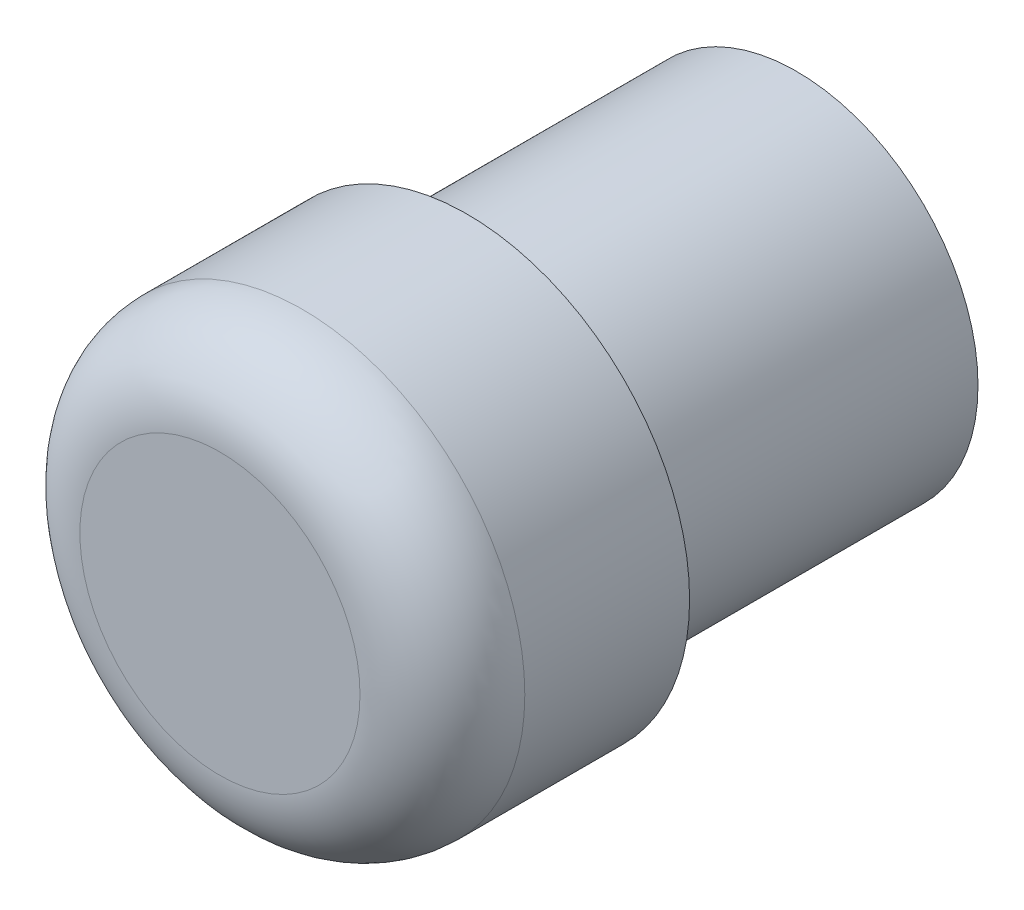
ISO-10303-21;
HEADER;
FILE_DESCRIPTION(('STEP AP214'),'2;1');
FILE_NAME('part.step','',(''),(''),'','','');
FILE_SCHEMA(('AUTOMOTIVE_DESIGN { 1 0 10303 214 1 1 1 1 }'));
ENDSEC;
DATA;
#1=APPLICATION_CONTEXT('core data for automotive mechanical design processes');
#2=APPLICATION_PROTOCOL_DEFINITION('international standard','automotive_design',2000,#1);
#3=PRODUCT_CONTEXT('',#1,'mechanical');
#4=PRODUCT('Part','Part','',(#3));
#5=PRODUCT_RELATED_PRODUCT_CATEGORY('part','',(#4));
#6=PRODUCT_DEFINITION_FORMATION('','',#4);
#7=PRODUCT_DEFINITION_CONTEXT('part definition',#1,'design');
#8=PRODUCT_DEFINITION('design','',#6,#7);
#9=PRODUCT_DEFINITION_SHAPE('','',#8);
#10=(LENGTH_UNIT() NAMED_UNIT(*) SI_UNIT(.MILLI.,.METRE.));
#11=(NAMED_UNIT(*) PLANE_ANGLE_UNIT() SI_UNIT($,.RADIAN.));
#12=(NAMED_UNIT(*) SI_UNIT($,.STERADIAN.) SOLID_ANGLE_UNIT());
#13=UNCERTAINTY_MEASURE_WITH_UNIT(LENGTH_MEASURE(1.E-05),#10,'distance_accuracy_value','');
#14=(GEOMETRIC_REPRESENTATION_CONTEXT(3) GLOBAL_UNCERTAINTY_ASSIGNED_CONTEXT((#13)) GLOBAL_UNIT_ASSIGNED_CONTEXT((#10,
#11,#12)) REPRESENTATION_CONTEXT('',''));
#15=CARTESIAN_POINT('',(0.,0.,0.));
#16=DIRECTION('',(0.,0.,1.));
#17=DIRECTION('',(1.,0.,0.));
#18=AXIS2_PLACEMENT_3D('',#15,#16,#17);
#19=CARTESIAN_POINT('',(-173.275516993862,0.,20.));
#20=DIRECTION('',(0.,0.,-1.));
#21=DIRECTION('',(-1.,0.,0.));
#22=AXIS2_PLACEMENT_3D('',#19,#20,#21);
#23=CYLINDRICAL_SURFACE('',#22,11.);
#24=CARTESIAN_POINT('',(-173.275516993862,0.,20.));
#25=DIRECTION('',(0.,0.,1.));
#26=DIRECTION('',(1.,0.,0.));
#27=AXIS2_PLACEMENT_3D('',#24,#25,#26);
#28=CIRCLE('',#27,11.);
#29=CARTESIAN_POINT('',(-162.275516993862,0.,20.));
#30=VERTEX_POINT('',#29);
#31=EDGE_CURVE('E47',#30,#30,#28,.T.);
#32=ORIENTED_EDGE('',*,*,#31,.F.);
#33=EDGE_LOOP('',(#32));
#34=FACE_BOUND('',#33,.T.);
#35=CARTESIAN_POINT('',(-173.275516993862,0.,0.));
#36=DIRECTION('',(0.,0.,1.));
#37=DIRECTION('',(1.,0.,0.));
#38=AXIS2_PLACEMENT_3D('',#35,#36,#37);
#39=CIRCLE('',#38,11.);
#40=CARTESIAN_POINT('',(-162.275516993862,0.,0.));
#41=VERTEX_POINT('',#40);
#42=EDGE_CURVE('E51',#41,#41,#39,.T.);
#43=ORIENTED_EDGE('',*,*,#42,.T.);
#44=EDGE_LOOP('',(#43));
#45=FACE_BOUND('',#44,.T.);
#46=ADVANCED_FACE('F36',(#34,#45),#23,.T.);
#47=CARTESIAN_POINT('',(-173.275516993862,0.,0.));
#48=DIRECTION('',(0.,0.,1.));
#49=DIRECTION('',(1.,0.,0.));
#50=AXIS2_PLACEMENT_3D('',#47,#48,#49);
#51=PLANE('',#50);
#52=ORIENTED_EDGE('',*,*,#42,.F.);
#53=EDGE_LOOP('',(#52));
#54=FACE_BOUND('',#53,.T.);
#55=ADVANCED_FACE('F75',(#54),#51,.F.);
#56=CARTESIAN_POINT('',(-173.275516993862,0.,35.));
#57=DIRECTION('',(0.,0.,-1.));
#58=DIRECTION('',(-1.,0.,0.));
#59=AXIS2_PLACEMENT_3D('',#56,#57,#58);
#60=CYLINDRICAL_SURFACE('',#59,13.5);
#61=CARTESIAN_POINT('',(-173.275516993862,0.,30.));
#62=DIRECTION('',(0.,0.,1.));
#63=DIRECTION('',(1.,0.,0.));
#64=AXIS2_PLACEMENT_3D('',#61,#62,#63);
#65=CIRCLE('',#64,13.5);
#66=CARTESIAN_POINT('',(-159.775516993862,0.,30.));
#67=VERTEX_POINT('',#66);
#68=EDGE_CURVE('E10',#67,#67,#65,.F.);
#69=ORIENTED_EDGE('',*,*,#68,.T.);
#70=EDGE_LOOP('',(#69));
#71=FACE_BOUND('',#70,.T.);
#72=CARTESIAN_POINT('',(-173.275516993862,0.,20.));
#73=DIRECTION('',(0.,0.,1.));
#74=DIRECTION('',(1.,0.,0.));
#75=AXIS2_PLACEMENT_3D('',#72,#73,#74);
#76=CIRCLE('',#75,13.5);
#77=CARTESIAN_POINT('',(-159.775516993862,0.,20.));
#78=VERTEX_POINT('',#77);
#79=EDGE_CURVE('E55',#78,#78,#76,.T.);
#80=ORIENTED_EDGE('',*,*,#79,.T.);
#81=EDGE_LOOP('',(#80));
#82=FACE_BOUND('',#81,.T.);
#83=ADVANCED_FACE('F60',(#71,#82),#60,.T.);
#84=CARTESIAN_POINT('',(-173.275516993862,0.,35.));
#85=DIRECTION('',(0.,0.,1.));
#86=DIRECTION('',(1.,0.,0.));
#87=AXIS2_PLACEMENT_3D('',#84,#85,#86);
#88=PLANE('',#87);
#89=CARTESIAN_POINT('',(-173.275516993862,0.,35.));
#90=DIRECTION('',(0.,0.,1.));
#91=DIRECTION('',(1.,0.,0.));
#92=AXIS2_PLACEMENT_3D('',#89,#90,#91);
#93=CIRCLE('',#92,8.5);
#94=CARTESIAN_POINT('',(-164.775516993862,0.,35.));
#95=VERTEX_POINT('',#94);
#96=EDGE_CURVE('E43',#95,#95,#93,.T.);
#97=ORIENTED_EDGE('',*,*,#96,.T.);
#98=EDGE_LOOP('',(#97));
#99=FACE_BOUND('',#98,.T.);
#100=ADVANCED_FACE('F64',(#99),#88,.T.);
#101=CARTESIAN_POINT('',(-173.275516993862,0.,20.));
#102=DIRECTION('',(0.,0.,1.));
#103=DIRECTION('',(1.,0.,0.));
#104=AXIS2_PLACEMENT_3D('',#101,#102,#103);
#105=PLANE('',#104);
#106=ORIENTED_EDGE('',*,*,#31,.T.);
#107=EDGE_LOOP('',(#106));
#108=FACE_BOUND('',#107,.T.);
#109=ORIENTED_EDGE('',*,*,#79,.F.);
#110=EDGE_LOOP('',(#109));
#111=FACE_BOUND('',#110,.T.);
#112=ADVANCED_FACE('F62',(#108,#111),#105,.F.);
#113=CARTESIAN_POINT('',(-173.275516993862,0.,30.));
#114=DIRECTION('',(0.,0.,1.));
#115=DIRECTION('',(1.,0.,0.));
#116=AXIS2_PLACEMENT_3D('',#113,#114,#115);
#117=TOROIDAL_SURFACE('',#116,8.5,5.);
#118=ORIENTED_EDGE('',*,*,#68,.F.);
#119=EDGE_LOOP('',(#118));
#120=FACE_BOUND('',#119,.T.);
#121=ORIENTED_EDGE('',*,*,#96,.F.);
#122=EDGE_LOOP('',(#121));
#123=FACE_BOUND('',#122,.T.);
#124=ADVANCED_FACE('F38',(#120,#123),#117,.T.);
#125=CLOSED_SHELL('',(#46,#55,#83,#100,#112,#124));
#126=MANIFOLD_SOLID_BREP('B2',#125);
#127=ADVANCED_BREP_SHAPE_REPRESENTATION('',(#18,#126),#14);
#128=SHAPE_DEFINITION_REPRESENTATION(#9,#127);
ENDSEC;
END-ISO-10303-21;
